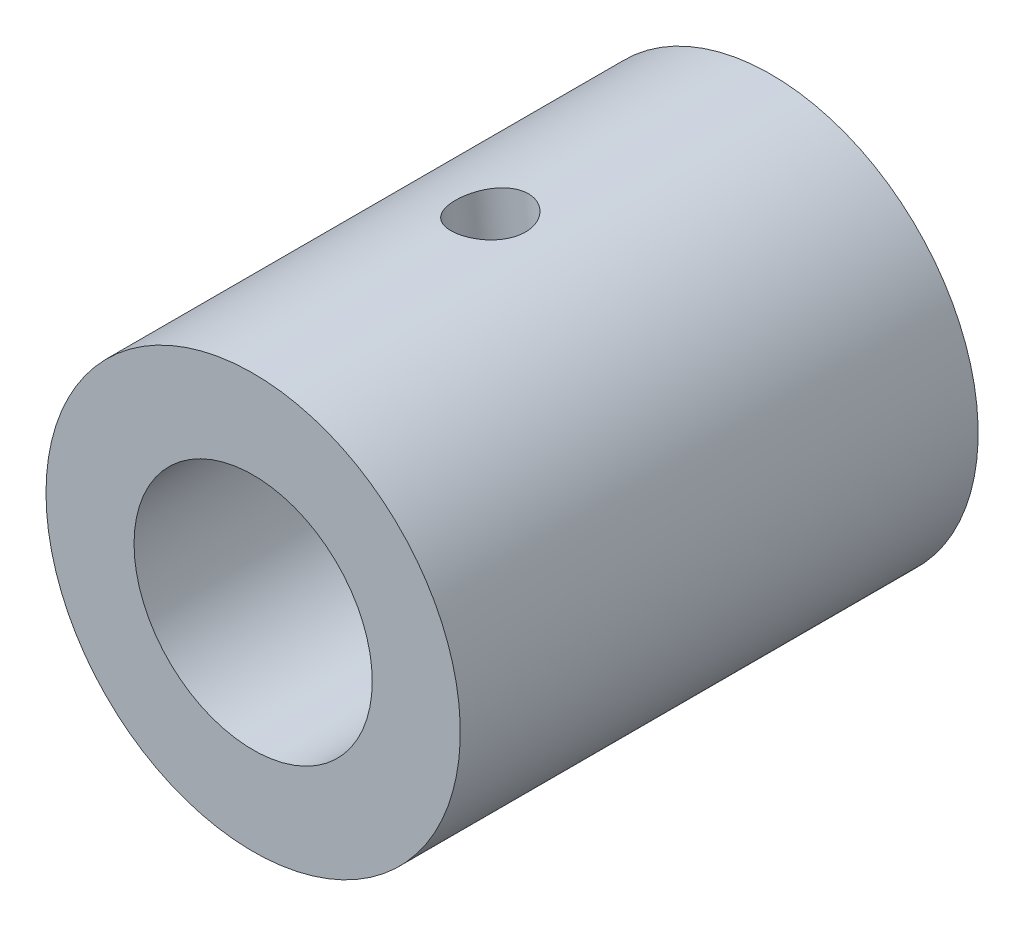
ISO-10303-21;
HEADER;
FILE_DESCRIPTION(('STEP AP214'),'2;1');
FILE_NAME('part.step','',(''),(''),'','','');
FILE_SCHEMA(('AUTOMOTIVE_DESIGN { 1 0 10303 214 1 1 1 1 }'));
ENDSEC;
DATA;
#1=APPLICATION_CONTEXT('core data for automotive mechanical design processes');
#2=APPLICATION_PROTOCOL_DEFINITION('international standard','automotive_design',2000,#1);
#3=PRODUCT_CONTEXT('',#1,'mechanical');
#4=PRODUCT('Part','Part','',(#3));
#5=PRODUCT_RELATED_PRODUCT_CATEGORY('part','',(#4));
#6=PRODUCT_DEFINITION_FORMATION('','',#4);
#7=PRODUCT_DEFINITION_CONTEXT('part definition',#1,'design');
#8=PRODUCT_DEFINITION('design','',#6,#7);
#9=PRODUCT_DEFINITION_SHAPE('','',#8);
#10=(LENGTH_UNIT() NAMED_UNIT(*) SI_UNIT(.MILLI.,.METRE.));
#11=(NAMED_UNIT(*) PLANE_ANGLE_UNIT() SI_UNIT($,.RADIAN.));
#12=(NAMED_UNIT(*) SI_UNIT($,.STERADIAN.) SOLID_ANGLE_UNIT());
#13=UNCERTAINTY_MEASURE_WITH_UNIT(LENGTH_MEASURE(1.E-05),#10,'distance_accuracy_value','');
#14=(GEOMETRIC_REPRESENTATION_CONTEXT(3) GLOBAL_UNCERTAINTY_ASSIGNED_CONTEXT((#13)) GLOBAL_UNIT_ASSIGNED_CONTEXT((#10,
#11,#12)) REPRESENTATION_CONTEXT('',''));
#15=CARTESIAN_POINT('',(0.,0.,0.));
#16=DIRECTION('',(0.,0.,1.));
#17=DIRECTION('',(1.,0.,0.));
#18=AXIS2_PLACEMENT_3D('',#15,#16,#17);
#19=CARTESIAN_POINT('',(-4.57966997657877E-13,0.,-37.4999999999992));
#20=DIRECTION('',(0.,0.,-0.999999999999993));
#21=DIRECTION('',(-1.00000000000003,0.,0.));
#22=AXIS2_PLACEMENT_3D('',#19,#20,#21);
#23=PLANE('',#22);
#24=CARTESIAN_POINT('',(-4.57966997657877E-13,0.,-37.4999999999992));
#25=DIRECTION('',(0.,0.,-0.999999999999993));
#26=DIRECTION('',(-1.00000000000003,0.,0.));
#27=AXIS2_PLACEMENT_3D('',#24,#25,#26);
#28=CIRCLE('',#27,20.);
#29=CARTESIAN_POINT('',(-20.0000000000011,-1.17805071253585E-13,-37.4999999999991));
#30=VERTEX_POINT('',#29);
#31=EDGE_CURVE('E10',#30,#30,#28,.T.);
#32=ORIENTED_EDGE('',*,*,#31,.T.);
#33=EDGE_LOOP('',(#32));
#34=FACE_BOUND('',#33,.T.);
#35=CARTESIAN_POINT('',(-4.57966997657877E-13,0.,-37.4999999999992));
#36=DIRECTION('',(0.,0.,-0.999999999999993));
#37=DIRECTION('',(-1.00000000000003,0.,0.));
#38=AXIS2_PLACEMENT_3D('',#35,#36,#37);
#39=CIRCLE('',#38,11.5);
#40=CARTESIAN_POINT('',(-11.5000000000008,0.,-37.4999999999991));
#41=VERTEX_POINT('',#40);
#42=EDGE_CURVE('E46',#41,#41,#39,.T.);
#43=ORIENTED_EDGE('',*,*,#42,.F.);
#44=EDGE_LOOP('',(#43));
#45=FACE_BOUND('',#44,.T.);
#46=ADVANCED_FACE('F34',(#34,#45),#23,.T.);
#47=CARTESIAN_POINT('',(-5.60315682740509E-13,-4.02455846426619E-13,12.4999999999996));
#48=DIRECTION('',(0.,0.,-0.999999999999993));
#49=DIRECTION('',(-1.00000000000003,0.,0.));
#50=AXIS2_PLACEMENT_3D('',#47,#48,#49);
#51=PLANE('',#50);
#52=CARTESIAN_POINT('',(-5.60315682740509E-13,-4.02455846426619E-13,12.4999999999996));
#53=DIRECTION('',(0.,0.,-0.999999999999993));
#54=DIRECTION('',(-1.00000000000003,0.,0.));
#55=AXIS2_PLACEMENT_3D('',#52,#53,#54);
#56=CIRCLE('',#55,20.);
#57=CARTESIAN_POINT('',(-20.0000000000012,-5.20260917680204E-13,12.4999999999996));
#58=VERTEX_POINT('',#57);
#59=EDGE_CURVE('E39',#58,#58,#56,.T.);
#60=ORIENTED_EDGE('',*,*,#59,.F.);
#61=EDGE_LOOP('',(#60));
#62=FACE_BOUND('',#61,.T.);
#63=CARTESIAN_POINT('',(-5.60315682740509E-13,-4.02455846426619E-13,12.4999999999996));
#64=DIRECTION('',(0.,0.,-0.999999999999993));
#65=DIRECTION('',(-1.00000000000003,0.,0.));
#66=AXIS2_PLACEMENT_3D('',#63,#64,#65);
#67=CIRCLE('',#66,11.5);
#68=CARTESIAN_POINT('',(-11.5000000000009,-4.70193762397431E-13,12.4999999999996));
#69=VERTEX_POINT('',#68);
#70=EDGE_CURVE('E48',#69,#69,#67,.T.);
#71=ORIENTED_EDGE('',*,*,#70,.T.);
#72=EDGE_LOOP('',(#71));
#73=FACE_BOUND('',#72,.T.);
#74=ADVANCED_FACE('F75',(#62,#73),#51,.F.);
#75=CARTESIAN_POINT('',(-4.57966997657877E-13,0.,-37.4999999999992));
#76=DIRECTION('',(0.,0.,0.999999999999993));
#77=DIRECTION('',(1.00000000000003,0.,0.));
#78=AXIS2_PLACEMENT_3D('',#75,#76,#77);
#79=CYLINDRICAL_SURFACE('',#78,20.);
#80=CARTESIAN_POINT('',(-5.46527088278104,19.2387841138113,-12.4999999999997));
#81=CARTESIAN_POINT('',(-5.46526372473833,19.2387883604695,-12.6894930700742));
#82=CARTESIAN_POINT('',(-5.44975690843791,19.2432121230377,-12.8790882269106));
#83=CARTESIAN_POINT('',(-5.38814418116816,19.26055262666,-13.2529548157546));
#84=CARTESIAN_POINT('',(-5.34201039658532,19.2734771041181,-13.4372212385141));
#85=CARTESIAN_POINT('',(-5.22051106839226,19.3067398515446,-13.7949657554835));
#86=CARTESIAN_POINT('',(-5.14517038012954,19.3270718167885,-13.9684528777127));
#87=CARTESIAN_POINT('',(-4.9673497405948,19.3735345973376,-14.3000165760003));
#88=CARTESIAN_POINT('',(-4.86487269966674,19.3996647907406,-14.45809480216));
#89=CARTESIAN_POINT('',(-4.6344337311403,19.4560063240787,-14.7559916066321));
#90=CARTESIAN_POINT('',(-4.50624656921296,19.4862529145342,-14.8956293123147));
#91=CARTESIAN_POINT('',(-4.22835764760484,19.5484328046034,-15.1511095091714));
#92=CARTESIAN_POINT('',(-4.07865459345789,19.5803662056279,-15.2669505676424));
#93=CARTESIAN_POINT('',(-3.7606861826755,19.64392138123,-15.4722302447949));
#94=CARTESIAN_POINT('',(-3.59231117534611,19.675539982678,-15.5615001836977));
#95=CARTESIAN_POINT('',(-3.24237477710286,19.736223082993,-15.7100189812012));
#96=CARTESIAN_POINT('',(-3.06081427885692,19.7652877544694,-15.7692698699523));
#97=CARTESIAN_POINT('',(-2.69142501260702,19.8189483335005,-15.8555144922008));
#98=CARTESIAN_POINT('',(-2.50367310966852,19.8435844453712,-15.8828122968209));
#99=CARTESIAN_POINT('',(-2.1256560435345,19.8876288710294,-15.9053216899481));
#100=CARTESIAN_POINT('',(-1.9353910587042,19.9070375537627,-15.9005355435205));
#101=CARTESIAN_POINT('',(-1.55982840394977,19.9399628895062,-15.8592494300525));
#102=CARTESIAN_POINT('',(-1.37449975245131,19.9535381894122,-15.8230767277179));
#103=CARTESIAN_POINT('',(-1.01205313985272,19.9752029039135,-15.7205599837032));
#104=CARTESIAN_POINT('',(-0.834935436859332,19.9832921461664,-15.6542149942812));
#105=CARTESIAN_POINT('',(-0.493059305852646,19.9946571624043,-15.4929137829022));
#106=CARTESIAN_POINT('',(-0.328363494415486,19.9979099199236,-15.3978233262804));
#107=CARTESIAN_POINT('',(-0.0168313332633815,20.0006005591956,-15.1818288772886));
#108=CARTESIAN_POINT('',(0.130003512457323,20.0000381199133,-15.0609227134488));
#109=CARTESIAN_POINT('',(0.403453760753713,19.9964045622477,-14.794915549658));
#110=CARTESIAN_POINT('',(0.529790610325855,19.9933018741122,-14.6495284686307));
#111=CARTESIAN_POINT('',(0.756304972573232,19.986017256875,-14.3396487129966));
#112=CARTESIAN_POINT('',(0.856482224657098,19.981835317023,-14.1751558480893));
#113=CARTESIAN_POINT('',(1.02776002733045,19.9737604266941,-13.8314016898673));
#114=CARTESIAN_POINT('',(1.09882553109278,19.9698678291339,-13.6521229061456));
#115=CARTESIAN_POINT('',(1.20944124075085,19.9634754391414,-13.2840714523178));
#116=CARTESIAN_POINT('',(1.24899434101899,19.9609755187999,-13.0952996558259));
#117=CARTESIAN_POINT('',(1.29499902285696,19.9580437284675,-12.7161319124076));
#118=CARTESIAN_POINT('',(1.30185564107186,19.9575865578519,-12.5257852600489));
#119=CARTESIAN_POINT('',(1.28334246046496,19.9587854074482,-12.146679088923));
#120=CARTESIAN_POINT('',(1.25797395893353,19.9604413425926,-11.9579195065729));
#121=CARTESIAN_POINT('',(1.17611547043641,19.9654300824297,-11.5886233197586));
#122=CARTESIAN_POINT('',(1.11983240004326,19.9687517255249,-11.40804059139));
#123=CARTESIAN_POINT('',(0.978041615750987,19.9761969495604,-11.0587582652358));
#124=CARTESIAN_POINT('',(0.892532090331144,19.9803205802028,-10.8900594048207));
#125=CARTESIAN_POINT('',(0.693880796836914,19.9882082186291,-10.5675556724472));
#126=CARTESIAN_POINT('',(0.5804821597076,19.9919684027752,-10.4139089674213));
#127=CARTESIAN_POINT('',(0.329767261414502,19.9976733310956,-10.12750818873));
#128=CARTESIAN_POINT('',(0.192449247279009,19.999617942146,-9.99475564768678));
#129=CARTESIAN_POINT('',(-0.103847390790137,20.000283949488,-9.75244544629599));
#130=CARTESIAN_POINT('',(-0.26304477622712,19.9989701608276,-9.64315495177871));
#131=CARTESIAN_POINT('',(-0.597389966767414,19.9917744192231,-9.45274470426654));
#132=CARTESIAN_POINT('',(-0.772537239749685,19.985892618628,-9.37162401190343));
#133=CARTESIAN_POINT('',(-1.13291122400467,19.9686974440934,-9.24026944054214));
#134=CARTESIAN_POINT('',(-1.31808859039119,19.9574088385897,-9.18989707417387));
#135=CARTESIAN_POINT('',(-1.69384332550939,19.9290332958102,-9.12102366772557));
#136=CARTESIAN_POINT('',(-1.8844202297522,19.9119468559067,-9.10251989459777));
#137=CARTESIAN_POINT('',(-2.26297371946324,19.872461258674,-9.09799010047213));
#138=CARTESIAN_POINT('',(-2.45095282998441,19.8501317097966,-9.11155804510897));
#139=CARTESIAN_POINT('',(-2.82137721481362,19.800877557309,-9.16990662434079));
#140=CARTESIAN_POINT('',(-3.00382252320222,19.7739529820045,-9.21468706666924));
#141=CARTESIAN_POINT('',(-3.35790322304126,19.7169123605787,-9.33403127836629));
#142=CARTESIAN_POINT('',(-3.52955134402452,19.6868001893837,-9.40855918459972));
#143=CARTESIAN_POINT('',(-3.85770052091894,19.6251383267956,-9.58523705252611));
#144=CARTESIAN_POINT('',(-4.01420081163282,19.5935885629004,-9.68738840863823));
#145=CARTESIAN_POINT('',(-4.30974819549337,19.5307245550487,-9.91784659196656));
#146=CARTESIAN_POINT('',(-4.44856546331812,19.4994175801566,-10.0464501703242));
#147=CARTESIAN_POINT('',(-4.70292576586448,19.4396400394713,-10.3255403260797));
#148=CARTESIAN_POINT('',(-4.81846334090589,19.4111701398339,-10.4760320225822));
#149=CARTESIAN_POINT('',(-5.02391494715005,19.3590193200893,-10.7959496819547));
#150=CARTESIAN_POINT('',(-5.1136331974969,19.335375366904,-10.9655074195405));
#151=CARTESIAN_POINT('',(-5.26371606278734,19.2950611077187,-11.3177944740025));
#152=CARTESIAN_POINT('',(-5.32410975805614,19.2783838953029,-11.5005105347556));
#153=CARTESIAN_POINT('',(-5.40093673369246,19.2569712011373,-11.8199276855204));
#154=CARTESIAN_POINT('',(-5.42502472668962,19.2501789082002,-11.9547038043629));
#155=CARTESIAN_POINT('',(-5.45719423126347,19.2410838743312,-12.2263022205992));
#156=CARTESIAN_POINT('',(-5.46527605321197,19.2387810463452,-12.363124478265));
#157=CARTESIAN_POINT('',(-5.46527088278104,19.2387841138113,-12.4999999999997));
#158=B_SPLINE_CURVE_WITH_KNOTS('',3,(#80,#81,#82,#83,#84,#85,#86,#87,#88,#89,#90,#91,#92,#93,
#94,#95,#96,#97,#98,#99,#100,#101,#102,#103,#104,#105,#106,#107,#108,#109,#110,#111,#112,#113,
#114,#115,#116,#117,#118,#119,#120,#121,#122,#123,#124,#125,#126,#127,#128,#129,#130,#131,#132,
#133,#134,#135,#136,#137,#138,#139,#140,#141,#142,#143,#144,#145,#146,#147,#148,#149,#150,#151,
#152,#153,#154,#155,#156,#157),.UNSPECIFIED.,.T.,.F.,(4,2,2,2,2,2,2,2,2,2,2,2,2,2,2,2,2,2,2,2,2,
2,2,2,2,2,2,2,2,2,2,2,2,2,2,2,2,2,4),(0.,0.567978626740774,1.1364748809502,1.70448839784013,
2.2724410205608,2.84560550067479,3.41880447867718,3.99556823755971,4.57229298542618,
5.14348371475877,5.71463411954709,6.2798997973671,6.84518323197778,7.41314829256004,
7.98116114595072,8.55634227567085,9.13152913489505,9.70740642494571,10.2832308153325,
10.8519031601942,11.4205526126732,11.9854415722246,12.5503655512022,13.1207015003056,
13.6910792650358,14.2676428594974,14.844187225654,15.4181153565192,15.9919942649069,
16.5586467387688,17.1252957221269,17.6912636146941,18.2572600823977,18.8299911133586,
19.4028563083734,19.9799573480914,20.5564849183703,20.9667578553508,21.3770228367499),.UNSPECIFIED.);
#159=CARTESIAN_POINT('',(-5.46527088278104,19.2387841138113,-12.4999999999997));
#160=VERTEX_POINT('',#159);
#161=EDGE_CURVE('E51',#160,#160,#158,.T.);
#162=ORIENTED_EDGE('',*,*,#161,.T.);
#163=EDGE_LOOP('',(#162));
#164=FACE_BOUND('',#163,.T.);
#165=ORIENTED_EDGE('',*,*,#31,.F.);
#166=EDGE_LOOP('',(#165));
#167=FACE_BOUND('',#166,.T.);
#168=ORIENTED_EDGE('',*,*,#59,.T.);
#169=EDGE_LOOP('',(#168));
#170=FACE_BOUND('',#169,.T.);
#171=ADVANCED_FACE('F36',(#164,#167,#170),#79,.T.);
#172=CARTESIAN_POINT('',(-4.57966997657877E-13,0.,-37.4999999999992));
#173=DIRECTION('',(0.,0.,0.999999999999993));
#174=DIRECTION('',(1.00000000000003,0.,0.));
#175=AXIS2_PLACEMENT_3D('',#172,#173,#174);
#176=CYLINDRICAL_SURFACE('',#175,11.5);
#177=CARTESIAN_POINT('',(-4.54276091061574,10.5647206924275,-12.4999999999995));
#178=CARTESIAN_POINT('',(-4.5427584972767,10.5647231190958,-12.6864439539246));
#179=CARTESIAN_POINT('',(-4.52796658235694,10.5711193712961,-12.8729142955337));
#180=CARTESIAN_POINT('',(-4.46929239387376,10.596056417957,-13.2404123940462));
#181=CARTESIAN_POINT('',(-4.42539975517173,10.6146015395917,-13.4214381876775));
#182=CARTESIAN_POINT('',(-4.31001197112943,10.6619720118323,-13.7726745309999));
#183=CARTESIAN_POINT('',(-4.2385617496023,10.6907806253005,-13.9429021604245));
#184=CARTESIAN_POINT('',(-4.07004819870096,10.756060650845,-14.2685503218663));
#185=CARTESIAN_POINT('',(-3.97298127631213,10.7925331377146,-14.4239687725735));
#186=CARTESIAN_POINT('',(-3.75256848782675,10.8711666681755,-14.7203636731584));
#187=CARTESIAN_POINT('',(-3.62856630676594,10.9134578025232,-14.8608176619618));
#188=CARTESIAN_POINT('',(-3.35891154526662,10.9994414411327,-15.1186480808394));
#189=CARTESIAN_POINT('',(-3.21325626415293,11.0431341196676,-15.236021627966));
#190=CARTESIAN_POINT('',(-2.90056866501946,11.1293973863256,-15.4466157219787));
#191=CARTESIAN_POINT('',(-2.73316659185787,11.171927967565,-15.5393053751041));
#192=CARTESIAN_POINT('',(-2.38370700921026,11.2516668508806,-15.6944181186452));
#193=CARTESIAN_POINT('',(-2.20165257427084,11.2888762649857,-15.756847539444));
#194=CARTESIAN_POINT('',(-1.83328674503313,11.3544294360146,-15.8479438953331));
#195=CARTESIAN_POINT('',(-1.64723488664593,11.382991134405,-15.8775022186441));
#196=CARTESIAN_POINT('',(-1.27167278947806,11.4310391537808,-15.9048339809377));
#197=CARTESIAN_POINT('',(-1.08216326477151,11.450527327062,-15.9026139101944));
#198=CARTESIAN_POINT('',(-0.711301322052311,11.4794425097186,-15.8670542581062));
#199=CARTESIAN_POINT('',(-0.529877939281322,11.4891621601691,-15.8346796550908));
#200=CARTESIAN_POINT('',(-0.174301930221528,11.5000555454771,-15.7413038539155));
#201=CARTESIAN_POINT('',(-0.000149759890083787,11.5012287452083,-15.6803008634767));
#202=CARTESIAN_POINT('',(0.338132770116534,11.4962878994023,-15.5307350155321));
#203=CARTESIAN_POINT('',(0.502125774269602,11.4900903791052,-15.4418650173294));
#204=CARTESIAN_POINT('',(0.813689812479238,11.4722402814037,-15.2393297380395));
#205=CARTESIAN_POINT('',(0.96125702872858,11.4605864390626,-15.1256587106052));
#206=CARTESIAN_POINT('',(1.24140852769125,11.4336987214979,-14.8717267856142));
#207=CARTESIAN_POINT('',(1.37322386177242,11.4183470276993,-14.7306289145052));
#208=CARTESIAN_POINT('',(1.61147881438293,11.3871687512868,-14.4284392986604));
#209=CARTESIAN_POINT('',(1.71791605969093,11.3713421244152,-14.2673456861716));
#210=CARTESIAN_POINT('',(1.90294410442337,11.3418560896327,-13.9277414477843));
#211=CARTESIAN_POINT('',(1.98127336669818,11.3282176579987,-13.7490859978452));
#212=CARTESIAN_POINT('',(2.10584858232268,11.3057266324676,-13.3806425480178));
#213=CARTESIAN_POINT('',(2.15210464872288,11.2968725302105,-13.190858077728));
#214=CARTESIAN_POINT('',(2.20960927005292,11.2857635518712,-12.8129225952773));
#215=CARTESIAN_POINT('',(2.22206696676773,11.2832809187656,-12.6249621049476));
#216=CARTESIAN_POINT('',(2.21495675836662,11.284679123332,-12.24968874778));
#217=CARTESIAN_POINT('',(2.19539318296411,11.2885591006924,-12.0623757968177));
#218=CARTESIAN_POINT('',(2.12592743083863,11.3018413102769,-11.698576861188));
#219=CARTESIAN_POINT('',(2.07679627595614,11.3111030009866,-11.5219372575998));
#220=CARTESIAN_POINT('',(1.95060573993989,11.3335438948314,-11.1792077094131));
#221=CARTESIAN_POINT('',(1.87354213206535,11.3467236908002,-11.0131193659047));
#222=CARTESIAN_POINT('',(1.69154705673481,11.3752952131914,-10.6913960372054));
#223=CARTESIAN_POINT('',(1.58593834175585,11.3907358456364,-10.5361489470364));
#224=CARTESIAN_POINT('',(1.35090877093821,11.4209920377947,-10.24477585065));
#225=CARTESIAN_POINT('',(1.22148238175744,11.4358074512713,-10.1086543006802));
#226=CARTESIAN_POINT('',(0.937115431717481,11.4626745687688,-9.8542786348097));
#227=CARTESIAN_POINT('',(0.781415981252479,11.4746056474378,-9.73685811584115));
#228=CARTESIAN_POINT('',(0.452377243113647,11.4922782136503,-9.52943686270943));
#229=CARTESIAN_POINT('',(0.279038849422119,11.4980200147098,-9.43943473984118));
#230=CARTESIAN_POINT('',(-0.0789785659266583,11.5011099317358,-9.29027218497409));
#231=CARTESIAN_POINT('',(-0.263560135370928,11.4985222509839,-9.23087991909394));
#232=CARTESIAN_POINT('',(-0.6397064981185,11.4837341530726,-9.14401586043125));
#233=CARTESIAN_POINT('',(-0.831269340982855,11.4715364014494,-9.11653522157973));
#234=CARTESIAN_POINT('',(-1.20818157230567,11.4378653900452,-9.09493142381484));
#235=CARTESIAN_POINT('',(-1.39349500622308,11.4167565816752,-9.09959764188848));
#236=CARTESIAN_POINT('',(-1.75964695238549,11.3660811649701,-9.13927239366026));
#237=CARTESIAN_POINT('',(-1.94048570536956,11.3365150127221,-9.1742792913549));
#238=CARTESIAN_POINT('',(-2.29086185338163,11.270910768312,-9.27290041149164));
#239=CARTESIAN_POINT('',(-2.46049545265294,11.2349415290815,-9.33622017906717));
#240=CARTESIAN_POINT('',(-2.78624341428447,11.1586229767827,-9.4894068378845));
#241=CARTESIAN_POINT('',(-2.94235558695959,11.1182729566579,-9.5792780185559));
#242=CARTESIAN_POINT('',(-3.24212077573517,11.0346563420819,-9.78628214572505));
#243=CARTESIAN_POINT('',(-3.38523053287526,10.991337983299,-9.90418067609256));
#244=CARTESIAN_POINT('',(-3.65003193382563,10.9062664986405,-10.1625042623454));
#245=CARTESIAN_POINT('',(-3.77171746730942,10.864513821971,-10.3029357230106));
#246=CARTESIAN_POINT('',(-3.9939595772798,10.7848342730107,-10.6071773832341));
#247=CARTESIAN_POINT('',(-4.09380957893353,10.7470515798657,-10.7715428493385));
#248=CARTESIAN_POINT('',(-4.26505364746962,10.6802535588441,-11.1160776822639));
#249=CARTESIAN_POINT('',(-4.33646209716145,10.6512338013768,-11.2962390047804));
#250=CARTESIAN_POINT('',(-4.44216566184716,10.6075465994135,-11.6457975079358));
#251=CARTESIAN_POINT('',(-4.47979546771632,10.5916083312057,-11.8140334911416));
#252=CARTESIAN_POINT('',(-4.53009188166394,10.5701952300858,-12.1548393216204));
#253=CARTESIAN_POINT('',(-4.54276314464987,10.5647184460545,-12.3274083546739));
#254=CARTESIAN_POINT('',(-4.54276091061574,10.5647206924275,-12.4999999999995));
#255=B_SPLINE_CURVE_WITH_KNOTS('',3,(#177,#178,#179,#180,#181,#182,#183,#184,#185,#186,#187,
#188,#189,#190,#191,#192,#193,#194,#195,#196,#197,#198,#199,#200,#201,#202,#203,#204,#205,#206,
#207,#208,#209,#210,#211,#212,#213,#214,#215,#216,#217,#218,#219,#220,#221,#222,#223,#224,#225,
#226,#227,#228,#229,#230,#231,#232,#233,#234,#235,#236,#237,#238,#239,#240,#241,#242,#243,#244,
#245,#246,#247,#248,#249,#250,#251,#252,#253,#254),.UNSPECIFIED.,.T.,.F.,(4,2,2,2,2,2,2,2,2,2,2,
2,2,2,2,2,2,2,2,2,2,2,2,2,2,2,2,2,2,2,2,2,2,2,2,2,2,2,4),(0.,0.558695483764701,1.11759007149259,
1.67557738544196,2.23364300467776,2.80724363096184,3.38091585949617,3.96607911639851,
4.55111990536712,5.11987649061,5.68851691726221,6.23956332832933,6.79064424223428,
7.34802614128686,7.90553732197306,8.48394601622547,9.0624087789289,9.64612235283974,
10.2296517912946,10.7920116430694,11.3542954623915,11.9025162688833,12.4508200668433,
13.0134896347277,13.5762900878846,14.1596345317963,14.7429494251781,15.3217789507306,
15.9004479833966,16.4574472094353,17.0144164033192,17.5657231648344,18.1171190397184,
18.685782181756,19.254607248375,19.8397564332221,20.4246093329908,20.941891657392,
21.4590774966157),.UNSPECIFIED.);
#256=CARTESIAN_POINT('',(-4.54276091061574,10.5647206924275,-12.4999999999995));
#257=VERTEX_POINT('',#256);
#258=EDGE_CURVE('E59',#257,#257,#255,.T.);
#259=ORIENTED_EDGE('',*,*,#258,.F.);
#260=EDGE_LOOP('',(#259));
#261=FACE_BOUND('',#260,.T.);
#262=ORIENTED_EDGE('',*,*,#42,.T.);
#263=EDGE_LOOP('',(#262));
#264=FACE_BOUND('',#263,.T.);
#265=ORIENTED_EDGE('',*,*,#70,.F.);
#266=EDGE_LOOP('',(#265));
#267=FACE_BOUND('',#266,.T.);
#268=ADVANCED_FACE('F66',(#261,#264,#267),#176,.F.);
#269=CARTESIAN_POINT('',(-2.11512544116538,19.8878416216573,-12.5000000000003));
#270=DIRECTION('',(-0.105756272058176,0.994392081082909,0.));
#271=DIRECTION('',(-0.994392081082919,-0.105756272058184,0.));
#272=AXIS2_PLACEMENT_3D('',#269,#270,#271);
#273=CYLINDRICAL_SURFACE('',#272,3.4);
#274=ORIENTED_EDGE('',*,*,#258,.T.);
#275=EDGE_LOOP('',(#274));
#276=FACE_BOUND('',#275,.T.);
#277=ORIENTED_EDGE('',*,*,#161,.F.);
#278=EDGE_LOOP('',(#277));
#279=FACE_BOUND('',#278,.T.);
#280=ADVANCED_FACE('F63',(#276,#279),#273,.F.);
#281=CLOSED_SHELL('',(#46,#74,#171,#268,#280));
#282=MANIFOLD_SOLID_BREP('B2',#281);
#283=ADVANCED_BREP_SHAPE_REPRESENTATION('',(#18,#282),#14);
#284=SHAPE_DEFINITION_REPRESENTATION(#9,#283);
ENDSEC;
END-ISO-10303-21;
